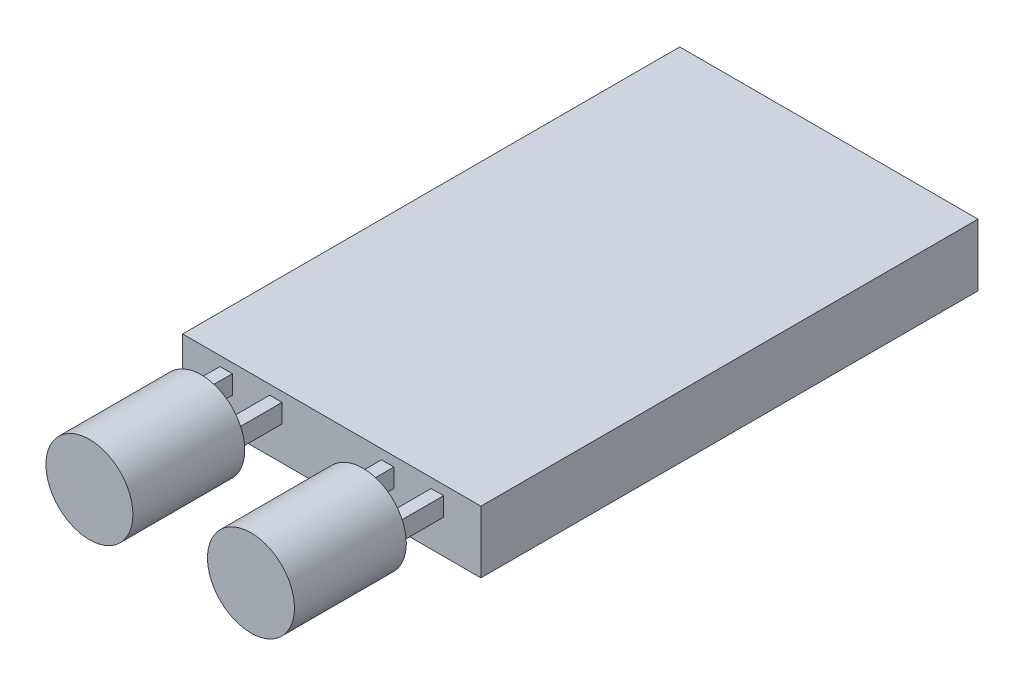
ISO-10303-21;
HEADER;
FILE_DESCRIPTION(('STEP AP214'),'2;1');
FILE_NAME('part.step','',(''),(''),'','','');
FILE_SCHEMA(('AUTOMOTIVE_DESIGN { 1 0 10303 214 1 1 1 1 }'));
ENDSEC;
DATA;
#1=APPLICATION_CONTEXT('core data for automotive mechanical design processes');
#2=APPLICATION_PROTOCOL_DEFINITION('international standard','automotive_design',2000,#1);
#3=PRODUCT_CONTEXT('',#1,'mechanical');
#4=PRODUCT('Part','Part','',(#3));
#5=PRODUCT_RELATED_PRODUCT_CATEGORY('part','',(#4));
#6=PRODUCT_DEFINITION_FORMATION('','',#4);
#7=PRODUCT_DEFINITION_CONTEXT('part definition',#1,'design');
#8=PRODUCT_DEFINITION('design','',#6,#7);
#9=PRODUCT_DEFINITION_SHAPE('','',#8);
#10=(LENGTH_UNIT() NAMED_UNIT(*) SI_UNIT(.MILLI.,.METRE.));
#11=(NAMED_UNIT(*) PLANE_ANGLE_UNIT() SI_UNIT($,.RADIAN.));
#12=(NAMED_UNIT(*) SI_UNIT($,.STERADIAN.) SOLID_ANGLE_UNIT());
#13=UNCERTAINTY_MEASURE_WITH_UNIT(LENGTH_MEASURE(1.E-05),#10,'distance_accuracy_value','');
#14=(GEOMETRIC_REPRESENTATION_CONTEXT(3) GLOBAL_UNCERTAINTY_ASSIGNED_CONTEXT((#13)) GLOBAL_UNIT_ASSIGNED_CONTEXT((#10,
#11,#12)) REPRESENTATION_CONTEXT('',''));
#15=CARTESIAN_POINT('',(0.,0.,0.));
#16=DIRECTION('',(0.,0.,1.));
#17=DIRECTION('',(1.,0.,0.));
#18=AXIS2_PLACEMENT_3D('',#15,#16,#17);
#19=CARTESIAN_POINT('',(-24.,5.,-9.42857142857144));
#20=DIRECTION('',(1.,0.,0.));
#21=DIRECTION('',(0.,0.,-1.));
#22=AXIS2_PLACEMENT_3D('',#19,#20,#21);
#23=PLANE('',#22);
#24=DIRECTION('',(0.,0.,1.));
#25=VECTOR('',#24,1.);
#26=CARTESIAN_POINT('',(-24.,0.,-9.42857142857144));
#27=LINE('',#26,#25);
#28=CARTESIAN_POINT('',(-24.,0.,-9.42857142857144));
#29=VERTEX_POINT('',#28);
#30=CARTESIAN_POINT('',(-24.,0.,30.5714285714286));
#31=VERTEX_POINT('',#30);
#32=EDGE_CURVE('E256',#29,#31,#27,.T.);
#33=ORIENTED_EDGE('',*,*,#32,.T.);
#34=DIRECTION('',(0.,-1.,0.));
#35=VECTOR('',#34,1.);
#36=CARTESIAN_POINT('',(-24.,5.,30.5714285714286));
#37=LINE('',#36,#35);
#38=CARTESIAN_POINT('',(-24.,5.,30.5714285714286));
#39=VERTEX_POINT('',#38);
#40=EDGE_CURVE('E11',#39,#31,#37,.T.);
#41=ORIENTED_EDGE('',*,*,#40,.F.);
#42=DIRECTION('',(0.,0.,1.));
#43=VECTOR('',#42,1.);
#44=CARTESIAN_POINT('',(-24.,5.,-9.42857142857144));
#45=LINE('',#44,#43);
#46=CARTESIAN_POINT('',(-24.,5.,-9.42857142857144));
#47=VERTEX_POINT('',#46);
#48=EDGE_CURVE('E257',#47,#39,#45,.T.);
#49=ORIENTED_EDGE('',*,*,#48,.F.);
#50=DIRECTION('',(0.,-1.,0.));
#51=VECTOR('',#50,1.);
#52=CARTESIAN_POINT('',(-24.,5.,-9.42857142857144));
#53=LINE('',#52,#51);
#54=EDGE_CURVE('E267',#47,#29,#53,.T.);
#55=ORIENTED_EDGE('',*,*,#54,.T.);
#56=EDGE_LOOP('',(#33,#41,#49,#55));
#57=FACE_BOUND('',#56,.T.);
#58=ADVANCED_FACE('F35',(#57),#23,.F.);
#59=CARTESIAN_POINT('',(-24.,5.,30.5714285714286));
#60=DIRECTION('',(0.,0.,-1.));
#61=DIRECTION('',(-1.,0.,0.));
#62=AXIS2_PLACEMENT_3D('',#59,#60,#61);
#63=PLANE('',#62);
#64=DIRECTION('',(0.,1.,0.));
#65=VECTOR('',#64,1.);
#66=CARTESIAN_POINT('',(-21.,5.,30.5714285714286));
#67=LINE('',#66,#65);
#68=CARTESIAN_POINT('',(-21.,2.72951883751349,30.5714285714286));
#69=VERTEX_POINT('',#68);
#70=CARTESIAN_POINT('',(-21.,4.22951883751349,30.5714285714286));
#71=VERTEX_POINT('',#70);
#72=EDGE_CURVE('E440',#69,#71,#67,.T.);
#73=ORIENTED_EDGE('',*,*,#72,.T.);
#74=DIRECTION('',(1.,0.,0.));
#75=VECTOR('',#74,1.);
#76=CARTESIAN_POINT('',(-24.,4.22951883751349,30.5714285714286));
#77=LINE('',#76,#75);
#78=CARTESIAN_POINT('',(-20.,4.22951883751349,30.5714285714286));
#79=VERTEX_POINT('',#78);
#80=EDGE_CURVE('E442',#71,#79,#77,.T.);
#81=ORIENTED_EDGE('',*,*,#80,.T.);
#82=DIRECTION('',(0.,-1.,0.));
#83=VECTOR('',#82,1.);
#84=CARTESIAN_POINT('',(-20.,5.,30.5714285714286));
#85=LINE('',#84,#83);
#86=CARTESIAN_POINT('',(-20.,2.72951883751349,30.5714285714286));
#87=VERTEX_POINT('',#86);
#88=EDGE_CURVE('E428',#79,#87,#85,.T.);
#89=ORIENTED_EDGE('',*,*,#88,.T.);
#90=DIRECTION('',(-1.,0.,0.));
#91=VECTOR('',#90,1.);
#92=CARTESIAN_POINT('',(-24.,2.72951883751348,30.5714285714286));
#93=LINE('',#92,#91);
#94=EDGE_CURVE('E437',#87,#69,#93,.T.);
#95=ORIENTED_EDGE('',*,*,#94,.T.);
#96=EDGE_LOOP('',(#73,#81,#89,#95));
#97=FACE_BOUND('',#96,.T.);
#98=DIRECTION('',(0.,1.,0.));
#99=VECTOR('',#98,1.);
#100=CARTESIAN_POINT('',(-17.,5.,30.5714285714286));
#101=LINE('',#100,#99);
#102=CARTESIAN_POINT('',(-17.,2.72951883751348,30.5714285714286));
#103=VERTEX_POINT('',#102);
#104=CARTESIAN_POINT('',(-17.,4.22951883751348,30.5714285714286));
#105=VERTEX_POINT('',#104);
#106=EDGE_CURVE('E201',#103,#105,#101,.T.);
#107=ORIENTED_EDGE('',*,*,#106,.T.);
#108=DIRECTION('',(1.,0.,0.));
#109=VECTOR('',#108,1.);
#110=CARTESIAN_POINT('',(-24.,4.22951883751348,30.5714285714286));
#111=LINE('',#110,#109);
#112=CARTESIAN_POINT('',(-16.,4.22951883751348,30.5714285714286));
#113=VERTEX_POINT('',#112);
#114=EDGE_CURVE('E198',#105,#113,#111,.T.);
#115=ORIENTED_EDGE('',*,*,#114,.T.);
#116=DIRECTION('',(0.,-1.,0.));
#117=VECTOR('',#116,1.);
#118=CARTESIAN_POINT('',(-16.,5.,30.5714285714286));
#119=LINE('',#118,#117);
#120=CARTESIAN_POINT('',(-16.,2.72951883751348,30.5714285714286));
#121=VERTEX_POINT('',#120);
#122=EDGE_CURVE('E460',#113,#121,#119,.T.);
#123=ORIENTED_EDGE('',*,*,#122,.T.);
#124=DIRECTION('',(-1.,0.,0.));
#125=VECTOR('',#124,1.);
#126=CARTESIAN_POINT('',(-24.,2.72951883751348,30.5714285714286));
#127=LINE('',#126,#125);
#128=EDGE_CURVE('E469',#121,#103,#127,.T.);
#129=ORIENTED_EDGE('',*,*,#128,.T.);
#130=EDGE_LOOP('',(#107,#115,#123,#129));
#131=FACE_BOUND('',#130,.T.);
#132=DIRECTION('',(1.,0.,0.));
#133=VECTOR('',#132,1.);
#134=CARTESIAN_POINT('',(-24.,4.22951883751349,30.5714285714286));
#135=LINE('',#134,#133);
#136=CARTESIAN_POINT('',(-8.,4.22951883751349,30.5714285714286));
#137=VERTEX_POINT('',#136);
#138=CARTESIAN_POINT('',(-7.,4.22951883751349,30.5714285714286));
#139=VERTEX_POINT('',#138);
#140=EDGE_CURVE('E216',#137,#139,#135,.T.);
#141=ORIENTED_EDGE('',*,*,#140,.T.);
#142=DIRECTION('',(0.,-1.,0.));
#143=VECTOR('',#142,1.);
#144=CARTESIAN_POINT('',(-7.,5.,30.5714285714286));
#145=LINE('',#144,#143);
#146=CARTESIAN_POINT('',(-7.,2.72951883751349,30.5714285714286));
#147=VERTEX_POINT('',#146);
#148=EDGE_CURVE('E219',#139,#147,#145,.T.);
#149=ORIENTED_EDGE('',*,*,#148,.T.);
#150=DIRECTION('',(-1.,0.,0.));
#151=VECTOR('',#150,1.);
#152=CARTESIAN_POINT('',(-24.,2.72951883751348,30.5714285714286));
#153=LINE('',#152,#151);
#154=CARTESIAN_POINT('',(-8.,2.72951883751349,30.5714285714286));
#155=VERTEX_POINT('',#154);
#156=EDGE_CURVE('E188',#147,#155,#153,.T.);
#157=ORIENTED_EDGE('',*,*,#156,.T.);
#158=DIRECTION('',(0.,1.,0.));
#159=VECTOR('',#158,1.);
#160=CARTESIAN_POINT('',(-8.,5.00000000000002,30.5714285714286));
#161=LINE('',#160,#159);
#162=EDGE_CURVE('E213',#155,#137,#161,.T.);
#163=ORIENTED_EDGE('',*,*,#162,.T.);
#164=EDGE_LOOP('',(#141,#149,#157,#163));
#165=FACE_BOUND('',#164,.T.);
#166=DIRECTION('',(1.,0.,0.));
#167=VECTOR('',#166,1.);
#168=CARTESIAN_POINT('',(-24.,4.22951883751348,30.5714285714286));
#169=LINE('',#168,#167);
#170=CARTESIAN_POINT('',(-4.,4.22951883751348,30.5714285714286));
#171=VERTEX_POINT('',#170);
#172=CARTESIAN_POINT('',(-3.,4.22951883751348,30.5714285714286));
#173=VERTEX_POINT('',#172);
#174=EDGE_CURVE('E250',#171,#173,#169,.T.);
#175=ORIENTED_EDGE('',*,*,#174,.T.);
#176=DIRECTION('',(0.,-1.,0.));
#177=VECTOR('',#176,1.);
#178=CARTESIAN_POINT('',(-3.,5.,30.5714285714286));
#179=LINE('',#178,#177);
#180=CARTESIAN_POINT('',(-3.,2.72951883751348,30.5714285714286));
#181=VERTEX_POINT('',#180);
#182=EDGE_CURVE('E253',#173,#181,#179,.T.);
#183=ORIENTED_EDGE('',*,*,#182,.T.);
#184=DIRECTION('',(-1.,0.,0.));
#185=VECTOR('',#184,1.);
#186=CARTESIAN_POINT('',(-24.,2.72951883751348,30.5714285714286));
#187=LINE('',#186,#185);
#188=CARTESIAN_POINT('',(-4.,2.72951883751348,30.5714285714286));
#189=VERTEX_POINT('',#188);
#190=EDGE_CURVE('E237',#181,#189,#187,.T.);
#191=ORIENTED_EDGE('',*,*,#190,.T.);
#192=DIRECTION('',(0.,1.,0.));
#193=VECTOR('',#192,1.);
#194=CARTESIAN_POINT('',(-4.,5.,30.5714285714286));
#195=LINE('',#194,#193);
#196=EDGE_CURVE('E247',#189,#171,#195,.T.);
#197=ORIENTED_EDGE('',*,*,#196,.T.);
#198=EDGE_LOOP('',(#175,#183,#191,#197));
#199=FACE_BOUND('',#198,.T.);
#200=DIRECTION('',(1.,0.,0.));
#201=VECTOR('',#200,1.);
#202=CARTESIAN_POINT('',(-24.,0.,30.5714285714286));
#203=LINE('',#202,#201);
#204=CARTESIAN_POINT('',(0.,0.,30.5714285714286));
#205=VERTEX_POINT('',#204);
#206=EDGE_CURVE('E270',#31,#205,#203,.T.);
#207=ORIENTED_EDGE('',*,*,#206,.T.);
#208=DIRECTION('',(0.,-1.,0.));
#209=VECTOR('',#208,1.);
#210=CARTESIAN_POINT('',(0.,5.,30.5714285714286));
#211=LINE('',#210,#209);
#212=CARTESIAN_POINT('',(0.,5.,30.5714285714286));
#213=VERTEX_POINT('',#212);
#214=EDGE_CURVE('E42',#213,#205,#211,.T.);
#215=ORIENTED_EDGE('',*,*,#214,.F.);
#216=DIRECTION('',(1.,0.,0.));
#217=VECTOR('',#216,1.);
#218=CARTESIAN_POINT('',(-24.,5.,30.5714285714286));
#219=LINE('',#218,#217);
#220=EDGE_CURVE('E260',#39,#213,#219,.T.);
#221=ORIENTED_EDGE('',*,*,#220,.F.);
#222=ORIENTED_EDGE('',*,*,#40,.T.);
#223=EDGE_LOOP('',(#207,#215,#221,#222));
#224=FACE_BOUND('',#223,.T.);
#225=ADVANCED_FACE('F300',(#97,#131,#165,#199,#224),#63,.F.);
#226=CARTESIAN_POINT('',(0.,5.,-9.42857142857144));
#227=DIRECTION('',(-1.,0.,0.));
#228=DIRECTION('',(0.,0.,1.));
#229=AXIS2_PLACEMENT_3D('',#226,#227,#228);
#230=PLANE('',#229);
#231=DIRECTION('',(0.,0.,-1.));
#232=VECTOR('',#231,1.);
#233=CARTESIAN_POINT('',(0.,0.,-9.42857142857144));
#234=LINE('',#233,#232);
#235=CARTESIAN_POINT('',(0.,0.,-9.42857142857144));
#236=VERTEX_POINT('',#235);
#237=EDGE_CURVE('E272',#205,#236,#234,.T.);
#238=ORIENTED_EDGE('',*,*,#237,.T.);
#239=DIRECTION('',(0.,-1.,0.));
#240=VECTOR('',#239,1.);
#241=CARTESIAN_POINT('',(0.,5.,-9.42857142857144));
#242=LINE('',#241,#240);
#243=CARTESIAN_POINT('',(0.,5.,-9.42857142857144));
#244=VERTEX_POINT('',#243);
#245=EDGE_CURVE('E277',#244,#236,#242,.T.);
#246=ORIENTED_EDGE('',*,*,#245,.F.);
#247=DIRECTION('',(0.,0.,-1.));
#248=VECTOR('',#247,1.);
#249=CARTESIAN_POINT('',(0.,5.,-9.42857142857144));
#250=LINE('',#249,#248);
#251=EDGE_CURVE('E263',#213,#244,#250,.T.);
#252=ORIENTED_EDGE('',*,*,#251,.F.);
#253=ORIENTED_EDGE('',*,*,#214,.T.);
#254=EDGE_LOOP('',(#238,#246,#252,#253));
#255=FACE_BOUND('',#254,.T.);
#256=ADVANCED_FACE('F284',(#255),#230,.F.);
#257=CARTESIAN_POINT('',(-24.,5.,-9.42857142857144));
#258=DIRECTION('',(0.,0.,1.));
#259=DIRECTION('',(1.,0.,0.));
#260=AXIS2_PLACEMENT_3D('',#257,#258,#259);
#261=PLANE('',#260);
#262=DIRECTION('',(-1.,0.,0.));
#263=VECTOR('',#262,1.);
#264=CARTESIAN_POINT('',(-24.,0.,-9.42857142857144));
#265=LINE('',#264,#263);
#266=EDGE_CURVE('E261',#236,#29,#265,.T.);
#267=ORIENTED_EDGE('',*,*,#266,.T.);
#268=ORIENTED_EDGE('',*,*,#54,.F.);
#269=DIRECTION('',(-1.,0.,0.));
#270=VECTOR('',#269,1.);
#271=CARTESIAN_POINT('',(-24.,5.,-9.42857142857144));
#272=LINE('',#271,#270);
#273=EDGE_CURVE('E265',#244,#47,#272,.T.);
#274=ORIENTED_EDGE('',*,*,#273,.F.);
#275=ORIENTED_EDGE('',*,*,#245,.T.);
#276=EDGE_LOOP('',(#267,#268,#274,#275));
#277=FACE_BOUND('',#276,.T.);
#278=ADVANCED_FACE('F293',(#277),#261,.F.);
#279=CARTESIAN_POINT('',(0.,5.,0.));
#280=DIRECTION('',(0.,1.,0.));
#281=DIRECTION('',(0.,0.,1.));
#282=AXIS2_PLACEMENT_3D('',#279,#280,#281);
#283=PLANE('',#282);
#284=ORIENTED_EDGE('',*,*,#48,.T.);
#285=ORIENTED_EDGE('',*,*,#220,.T.);
#286=ORIENTED_EDGE('',*,*,#251,.T.);
#287=ORIENTED_EDGE('',*,*,#273,.T.);
#288=EDGE_LOOP('',(#284,#285,#286,#287));
#289=FACE_BOUND('',#288,.T.);
#290=ADVANCED_FACE('F299',(#289),#283,.T.);
#291=CARTESIAN_POINT('',(0.,0.,0.));
#292=DIRECTION('',(0.,1.,0.));
#293=DIRECTION('',(0.,0.,1.));
#294=AXIS2_PLACEMENT_3D('',#291,#292,#293);
#295=PLANE('',#294);
#296=ORIENTED_EDGE('',*,*,#32,.F.);
#297=ORIENTED_EDGE('',*,*,#266,.F.);
#298=ORIENTED_EDGE('',*,*,#237,.F.);
#299=ORIENTED_EDGE('',*,*,#206,.F.);
#300=EDGE_LOOP('',(#296,#297,#298,#299));
#301=FACE_BOUND('',#300,.T.);
#302=ADVANCED_FACE('F290',(#301),#295,.F.);
#303=CARTESIAN_POINT('',(-3.,4.22951883751348,34.5714285714286));
#304=DIRECTION('',(1.,0.,0.));
#305=DIRECTION('',(0.,0.,-1.));
#306=AXIS2_PLACEMENT_3D('',#303,#304,#305);
#307=PLANE('',#306);
#308=ORIENTED_EDGE('',*,*,#182,.F.);
#309=DIRECTION('',(0.,0.,-1.));
#310=VECTOR('',#309,1.);
#311=CARTESIAN_POINT('',(-3.,4.22951883751348,34.5714285714286));
#312=LINE('',#311,#310);
#313=CARTESIAN_POINT('',(-3.,4.22951883751348,34.5714285714286));
#314=VERTEX_POINT('',#313);
#315=EDGE_CURVE('E234',#314,#173,#312,.T.);
#316=ORIENTED_EDGE('',*,*,#315,.F.);
#317=DIRECTION('',(0.,-1.,0.));
#318=VECTOR('',#317,1.);
#319=CARTESIAN_POINT('',(-3.,4.22951883751348,34.5714285714286));
#320=LINE('',#319,#318);
#321=CARTESIAN_POINT('',(-3.,2.72951883751348,34.5714285714286));
#322=VERTEX_POINT('',#321);
#323=EDGE_CURVE('E221',#314,#322,#320,.T.);
#324=ORIENTED_EDGE('',*,*,#323,.T.);
#325=DIRECTION('',(0.,0.,-1.));
#326=VECTOR('',#325,1.);
#327=CARTESIAN_POINT('',(-3.,2.72951883751348,34.5714285714286));
#328=LINE('',#327,#326);
#329=EDGE_CURVE('E233',#322,#181,#328,.T.);
#330=ORIENTED_EDGE('',*,*,#329,.T.);
#331=EDGE_LOOP('',(#308,#316,#324,#330));
#332=FACE_BOUND('',#331,.T.);
#333=ADVANCED_FACE('F315',(#332),#307,.T.);
#334=CARTESIAN_POINT('',(-3.,4.22951883751348,34.5714285714286));
#335=DIRECTION('',(0.,1.,0.));
#336=DIRECTION('',(0.,0.,1.));
#337=AXIS2_PLACEMENT_3D('',#334,#335,#336);
#338=PLANE('',#337);
#339=ORIENTED_EDGE('',*,*,#174,.F.);
#340=DIRECTION('',(0.,0.,-1.));
#341=VECTOR('',#340,1.);
#342=CARTESIAN_POINT('',(-4.,4.22951883751348,34.5714285714286));
#343=LINE('',#342,#341);
#344=CARTESIAN_POINT('',(-4.,4.22951883751348,34.5714285714286));
#345=VERTEX_POINT('',#344);
#346=EDGE_CURVE('E238',#345,#171,#343,.T.);
#347=ORIENTED_EDGE('',*,*,#346,.F.);
#348=DIRECTION('',(1.,0.,0.));
#349=VECTOR('',#348,1.);
#350=CARTESIAN_POINT('',(-3.,4.22951883751348,34.5714285714286));
#351=LINE('',#350,#349);
#352=EDGE_CURVE('E230',#345,#314,#351,.T.);
#353=ORIENTED_EDGE('',*,*,#352,.T.);
#354=ORIENTED_EDGE('',*,*,#315,.T.);
#355=EDGE_LOOP('',(#339,#347,#353,#354));
#356=FACE_BOUND('',#355,.T.);
#357=ADVANCED_FACE('F320',(#356),#338,.T.);
#358=CARTESIAN_POINT('',(-4.,4.22951883751348,34.5714285714286));
#359=DIRECTION('',(-1.,0.,0.));
#360=DIRECTION('',(0.,0.,1.));
#361=AXIS2_PLACEMENT_3D('',#358,#359,#360);
#362=PLANE('',#361);
#363=ORIENTED_EDGE('',*,*,#196,.F.);
#364=DIRECTION('',(0.,0.,-1.));
#365=VECTOR('',#364,1.);
#366=CARTESIAN_POINT('',(-4.,2.72951883751348,34.5714285714286));
#367=LINE('',#366,#365);
#368=CARTESIAN_POINT('',(-4.,2.72951883751348,34.5714285714286));
#369=VERTEX_POINT('',#368);
#370=EDGE_CURVE('E241',#369,#189,#367,.T.);
#371=ORIENTED_EDGE('',*,*,#370,.F.);
#372=DIRECTION('',(0.,1.,0.));
#373=VECTOR('',#372,1.);
#374=CARTESIAN_POINT('',(-4.,4.22951883751348,34.5714285714286));
#375=LINE('',#374,#373);
#376=EDGE_CURVE('E227',#369,#345,#375,.T.);
#377=ORIENTED_EDGE('',*,*,#376,.T.);
#378=ORIENTED_EDGE('',*,*,#346,.T.);
#379=EDGE_LOOP('',(#363,#371,#377,#378));
#380=FACE_BOUND('',#379,.T.);
#381=ADVANCED_FACE('F325',(#380),#362,.T.);
#382=CARTESIAN_POINT('',(-3.,2.72951883751348,34.5714285714286));
#383=DIRECTION('',(0.,-1.,0.));
#384=DIRECTION('',(0.,0.,-1.));
#385=AXIS2_PLACEMENT_3D('',#382,#383,#384);
#386=PLANE('',#385);
#387=ORIENTED_EDGE('',*,*,#190,.F.);
#388=ORIENTED_EDGE('',*,*,#329,.F.);
#389=DIRECTION('',(-1.,0.,0.));
#390=VECTOR('',#389,1.);
#391=CARTESIAN_POINT('',(-3.,2.72951883751348,34.5714285714286));
#392=LINE('',#391,#390);
#393=EDGE_CURVE('E224',#322,#369,#392,.T.);
#394=ORIENTED_EDGE('',*,*,#393,.T.);
#395=ORIENTED_EDGE('',*,*,#370,.T.);
#396=EDGE_LOOP('',(#387,#388,#394,#395));
#397=FACE_BOUND('',#396,.T.);
#398=ADVANCED_FACE('F322',(#397),#386,.T.);
#399=CARTESIAN_POINT('',(-7.,4.22951883751349,34.5714285714286));
#400=DIRECTION('',(1.,0.,0.));
#401=DIRECTION('',(0.,0.,-1.));
#402=AXIS2_PLACEMENT_3D('',#399,#400,#401);
#403=PLANE('',#402);
#404=ORIENTED_EDGE('',*,*,#148,.F.);
#405=DIRECTION('',(0.,0.,-1.));
#406=VECTOR('',#405,1.);
#407=CARTESIAN_POINT('',(-7.,4.22951883751349,34.5714285714286));
#408=LINE('',#407,#406);
#409=CARTESIAN_POINT('',(-7.,4.22951883751349,34.5714285714286));
#410=VERTEX_POINT('',#409);
#411=EDGE_CURVE('E196',#410,#139,#408,.T.);
#412=ORIENTED_EDGE('',*,*,#411,.F.);
#413=DIRECTION('',(0.,-1.,0.));
#414=VECTOR('',#413,1.);
#415=CARTESIAN_POINT('',(-7.,4.22951883751349,34.5714285714286));
#416=LINE('',#415,#414);
#417=CARTESIAN_POINT('',(-7.,2.72951883751349,34.5714285714286));
#418=VERTEX_POINT('',#417);
#419=EDGE_CURVE('E177',#410,#418,#416,.T.);
#420=ORIENTED_EDGE('',*,*,#419,.T.);
#421=DIRECTION('',(0.,0.,-1.));
#422=VECTOR('',#421,1.);
#423=CARTESIAN_POINT('',(-7.,2.72951883751349,34.5714285714286));
#424=LINE('',#423,#422);
#425=EDGE_CURVE('E185',#418,#147,#424,.T.);
#426=ORIENTED_EDGE('',*,*,#425,.T.);
#427=EDGE_LOOP('',(#404,#412,#420,#426));
#428=FACE_BOUND('',#427,.T.);
#429=ADVANCED_FACE('F194',(#428),#403,.T.);
#430=CARTESIAN_POINT('',(-7.,4.22951883751349,34.5714285714286));
#431=DIRECTION('',(0.,1.,0.));
#432=DIRECTION('',(0.,0.,1.));
#433=AXIS2_PLACEMENT_3D('',#430,#431,#432);
#434=PLANE('',#433);
#435=ORIENTED_EDGE('',*,*,#140,.F.);
#436=DIRECTION('',(0.,0.,-1.));
#437=VECTOR('',#436,1.);
#438=CARTESIAN_POINT('',(-8.,4.22951883751349,34.5714285714286));
#439=LINE('',#438,#437);
#440=CARTESIAN_POINT('',(-8.,4.22951883751349,34.5714285714286));
#441=VERTEX_POINT('',#440);
#442=EDGE_CURVE('E208',#441,#137,#439,.T.);
#443=ORIENTED_EDGE('',*,*,#442,.F.);
#444=DIRECTION('',(1.,0.,0.));
#445=VECTOR('',#444,1.);
#446=CARTESIAN_POINT('',(-7.,4.22951883751349,34.5714285714286));
#447=LINE('',#446,#445);
#448=EDGE_CURVE('E192',#441,#410,#447,.T.);
#449=ORIENTED_EDGE('',*,*,#448,.T.);
#450=ORIENTED_EDGE('',*,*,#411,.T.);
#451=EDGE_LOOP('',(#435,#443,#449,#450));
#452=FACE_BOUND('',#451,.T.);
#453=ADVANCED_FACE('F335',(#452),#434,.T.);
#454=CARTESIAN_POINT('',(-8.,4.22951883751349,34.5714285714286));
#455=DIRECTION('',(-1.,0.,0.));
#456=DIRECTION('',(0.,-1.,0.));
#457=AXIS2_PLACEMENT_3D('',#454,#455,#456);
#458=PLANE('',#457);
#459=ORIENTED_EDGE('',*,*,#162,.F.);
#460=DIRECTION('',(0.,0.,-1.));
#461=VECTOR('',#460,1.);
#462=CARTESIAN_POINT('',(-8.,2.72951883751349,34.5714285714286));
#463=LINE('',#462,#461);
#464=CARTESIAN_POINT('',(-8.,2.72951883751349,34.5714285714286));
#465=VERTEX_POINT('',#464);
#466=EDGE_CURVE('E191',#465,#155,#463,.T.);
#467=ORIENTED_EDGE('',*,*,#466,.F.);
#468=DIRECTION('',(0.,1.,0.));
#469=VECTOR('',#468,1.);
#470=CARTESIAN_POINT('',(-8.,4.22951883751349,34.5714285714286));
#471=LINE('',#470,#469);
#472=EDGE_CURVE('E180',#465,#441,#471,.T.);
#473=ORIENTED_EDGE('',*,*,#472,.T.);
#474=ORIENTED_EDGE('',*,*,#442,.T.);
#475=EDGE_LOOP('',(#459,#467,#473,#474));
#476=FACE_BOUND('',#475,.T.);
#477=ADVANCED_FACE('F339',(#476),#458,.T.);
#478=CARTESIAN_POINT('',(-7.,2.72951883751349,34.5714285714286));
#479=DIRECTION('',(0.,-1.,0.));
#480=DIRECTION('',(1.,0.,0.));
#481=AXIS2_PLACEMENT_3D('',#478,#479,#480);
#482=PLANE('',#481);
#483=ORIENTED_EDGE('',*,*,#156,.F.);
#484=ORIENTED_EDGE('',*,*,#425,.F.);
#485=DIRECTION('',(-1.,0.,0.));
#486=VECTOR('',#485,1.);
#487=CARTESIAN_POINT('',(-7.,2.72951883751349,34.5714285714286));
#488=LINE('',#487,#486);
#489=EDGE_CURVE('E172',#418,#465,#488,.T.);
#490=ORIENTED_EDGE('',*,*,#489,.T.);
#491=ORIENTED_EDGE('',*,*,#466,.T.);
#492=EDGE_LOOP('',(#483,#484,#490,#491));
#493=FACE_BOUND('',#492,.T.);
#494=ADVANCED_FACE('F186',(#493),#482,.T.);
#495=CARTESIAN_POINT('',(-16.,4.22951883751348,34.5714285714286));
#496=DIRECTION('',(0.,1.,0.));
#497=DIRECTION('',(0.,0.,1.));
#498=AXIS2_PLACEMENT_3D('',#495,#496,#497);
#499=PLANE('',#498);
#500=ORIENTED_EDGE('',*,*,#114,.F.);
#501=DIRECTION('',(0.,0.,-1.));
#502=VECTOR('',#501,1.);
#503=CARTESIAN_POINT('',(-17.,4.22951883751348,34.5714285714286));
#504=LINE('',#503,#502);
#505=CARTESIAN_POINT('',(-17.,4.22951883751348,34.5714285714286));
#506=VERTEX_POINT('',#505);
#507=EDGE_CURVE('E457',#506,#105,#504,.T.);
#508=ORIENTED_EDGE('',*,*,#507,.F.);
#509=DIRECTION('',(1.,0.,0.));
#510=VECTOR('',#509,1.);
#511=CARTESIAN_POINT('',(-16.,4.22951883751348,34.5714285714286));
#512=LINE('',#511,#510);
#513=CARTESIAN_POINT('',(-16.,4.22951883751348,34.5714285714286));
#514=VERTEX_POINT('',#513);
#515=EDGE_CURVE('E445',#506,#514,#512,.T.);
#516=ORIENTED_EDGE('',*,*,#515,.T.);
#517=DIRECTION('',(0.,0.,-1.));
#518=VECTOR('',#517,1.);
#519=CARTESIAN_POINT('',(-16.,4.22951883751348,34.5714285714286));
#520=LINE('',#519,#518);
#521=EDGE_CURVE('E456',#514,#113,#520,.T.);
#522=ORIENTED_EDGE('',*,*,#521,.T.);
#523=EDGE_LOOP('',(#500,#508,#516,#522));
#524=FACE_BOUND('',#523,.T.);
#525=ADVANCED_FACE('F338',(#524),#499,.T.);
#526=CARTESIAN_POINT('',(-17.,4.22951883751348,34.5714285714286));
#527=DIRECTION('',(-1.,0.,0.));
#528=DIRECTION('',(0.,0.,1.));
#529=AXIS2_PLACEMENT_3D('',#526,#527,#528);
#530=PLANE('',#529);
#531=ORIENTED_EDGE('',*,*,#106,.F.);
#532=DIRECTION('',(0.,0.,-1.));
#533=VECTOR('',#532,1.);
#534=CARTESIAN_POINT('',(-17.,2.72951883751348,34.5714285714286));
#535=LINE('',#534,#533);
#536=CARTESIAN_POINT('',(-17.,2.72951883751348,34.5714285714286));
#537=VERTEX_POINT('',#536);
#538=EDGE_CURVE('E461',#537,#103,#535,.T.);
#539=ORIENTED_EDGE('',*,*,#538,.F.);
#540=DIRECTION('',(0.,1.,0.));
#541=VECTOR('',#540,1.);
#542=CARTESIAN_POINT('',(-17.,4.22951883751348,34.5714285714286));
#543=LINE('',#542,#541);
#544=EDGE_CURVE('E453',#537,#506,#543,.T.);
#545=ORIENTED_EDGE('',*,*,#544,.T.);
#546=ORIENTED_EDGE('',*,*,#507,.T.);
#547=EDGE_LOOP('',(#531,#539,#545,#546));
#548=FACE_BOUND('',#547,.T.);
#549=ADVANCED_FACE('F348',(#548),#530,.T.);
#550=CARTESIAN_POINT('',(-16.,2.72951883751348,34.5714285714286));
#551=DIRECTION('',(0.,-1.,0.));
#552=DIRECTION('',(0.,0.,-1.));
#553=AXIS2_PLACEMENT_3D('',#550,#551,#552);
#554=PLANE('',#553);
#555=ORIENTED_EDGE('',*,*,#128,.F.);
#556=DIRECTION('',(0.,0.,-1.));
#557=VECTOR('',#556,1.);
#558=CARTESIAN_POINT('',(-16.,2.72951883751348,34.5714285714286));
#559=LINE('',#558,#557);
#560=CARTESIAN_POINT('',(-16.,2.72951883751348,34.5714285714286));
#561=VERTEX_POINT('',#560);
#562=EDGE_CURVE('E57',#561,#121,#559,.T.);
#563=ORIENTED_EDGE('',*,*,#562,.F.);
#564=DIRECTION('',(-1.,0.,0.));
#565=VECTOR('',#564,1.);
#566=CARTESIAN_POINT('',(-16.,2.72951883751348,34.5714285714286));
#567=LINE('',#566,#565);
#568=EDGE_CURVE('E450',#561,#537,#567,.T.);
#569=ORIENTED_EDGE('',*,*,#568,.T.);
#570=ORIENTED_EDGE('',*,*,#538,.T.);
#571=EDGE_LOOP('',(#555,#563,#569,#570));
#572=FACE_BOUND('',#571,.T.);
#573=ADVANCED_FACE('F354',(#572),#554,.T.);
#574=CARTESIAN_POINT('',(-16.,4.22951883751348,34.5714285714286));
#575=DIRECTION('',(1.,0.,0.));
#576=DIRECTION('',(0.,0.,-1.));
#577=AXIS2_PLACEMENT_3D('',#574,#575,#576);
#578=PLANE('',#577);
#579=ORIENTED_EDGE('',*,*,#122,.F.);
#580=ORIENTED_EDGE('',*,*,#521,.F.);
#581=DIRECTION('',(0.,-1.,0.));
#582=VECTOR('',#581,1.);
#583=CARTESIAN_POINT('',(-16.,4.22951883751348,34.5714285714286));
#584=LINE('',#583,#582);
#585=EDGE_CURVE('E448',#514,#561,#584,.T.);
#586=ORIENTED_EDGE('',*,*,#585,.T.);
#587=ORIENTED_EDGE('',*,*,#562,.T.);
#588=EDGE_LOOP('',(#579,#580,#586,#587));
#589=FACE_BOUND('',#588,.T.);
#590=ADVANCED_FACE('F350',(#589),#578,.T.);
#591=CARTESIAN_POINT('',(-20.,4.22951883751349,34.5714285714286));
#592=DIRECTION('',(0.,1.,0.));
#593=DIRECTION('',(0.,0.,1.));
#594=AXIS2_PLACEMENT_3D('',#591,#592,#593);
#595=PLANE('',#594);
#596=ORIENTED_EDGE('',*,*,#80,.F.);
#597=DIRECTION('',(0.,0.,-1.));
#598=VECTOR('',#597,1.);
#599=CARTESIAN_POINT('',(-21.,4.22951883751349,34.5714285714286));
#600=LINE('',#599,#598);
#601=CARTESIAN_POINT('',(-21.,4.22951883751349,34.5714285714286));
#602=VERTEX_POINT('',#601);
#603=EDGE_CURVE('E425',#602,#71,#600,.T.);
#604=ORIENTED_EDGE('',*,*,#603,.F.);
#605=DIRECTION('',(1.,0.,0.));
#606=VECTOR('',#605,1.);
#607=CARTESIAN_POINT('',(-20.,4.22951883751349,34.5714285714286));
#608=LINE('',#607,#606);
#609=CARTESIAN_POINT('',(-20.,4.22951883751349,34.5714285714286));
#610=VERTEX_POINT('',#609);
#611=EDGE_CURVE('E412',#602,#610,#608,.T.);
#612=ORIENTED_EDGE('',*,*,#611,.T.);
#613=DIRECTION('',(0.,0.,-1.));
#614=VECTOR('',#613,1.);
#615=CARTESIAN_POINT('',(-20.,4.22951883751349,34.5714285714286));
#616=LINE('',#615,#614);
#617=EDGE_CURVE('E424',#610,#79,#616,.T.);
#618=ORIENTED_EDGE('',*,*,#617,.T.);
#619=EDGE_LOOP('',(#596,#604,#612,#618));
#620=FACE_BOUND('',#619,.T.);
#621=ADVANCED_FACE('F353',(#620),#595,.T.);
#622=CARTESIAN_POINT('',(-21.,4.22951883751349,34.5714285714286));
#623=DIRECTION('',(-1.,0.,0.));
#624=DIRECTION('',(0.,0.,1.));
#625=AXIS2_PLACEMENT_3D('',#622,#623,#624);
#626=PLANE('',#625);
#627=ORIENTED_EDGE('',*,*,#72,.F.);
#628=DIRECTION('',(0.,0.,-1.));
#629=VECTOR('',#628,1.);
#630=CARTESIAN_POINT('',(-21.,2.72951883751349,34.5714285714286));
#631=LINE('',#630,#629);
#632=CARTESIAN_POINT('',(-21.,2.72951883751349,34.5714285714286));
#633=VERTEX_POINT('',#632);
#634=EDGE_CURVE('E429',#633,#69,#631,.T.);
#635=ORIENTED_EDGE('',*,*,#634,.F.);
#636=DIRECTION('',(0.,1.,0.));
#637=VECTOR('',#636,1.);
#638=CARTESIAN_POINT('',(-21.,4.22951883751349,34.5714285714286));
#639=LINE('',#638,#637);
#640=EDGE_CURVE('E421',#633,#602,#639,.T.);
#641=ORIENTED_EDGE('',*,*,#640,.T.);
#642=ORIENTED_EDGE('',*,*,#603,.T.);
#643=EDGE_LOOP('',(#627,#635,#641,#642));
#644=FACE_BOUND('',#643,.T.);
#645=ADVANCED_FACE('F363',(#644),#626,.T.);
#646=CARTESIAN_POINT('',(-20.,2.72951883751349,34.5714285714286));
#647=DIRECTION('',(0.,-1.,0.));
#648=DIRECTION('',(1.,0.,0.));
#649=AXIS2_PLACEMENT_3D('',#646,#647,#648);
#650=PLANE('',#649);
#651=ORIENTED_EDGE('',*,*,#94,.F.);
#652=DIRECTION('',(0.,0.,-1.));
#653=VECTOR('',#652,1.);
#654=CARTESIAN_POINT('',(-20.,2.72951883751349,34.5714285714286));
#655=LINE('',#654,#653);
#656=CARTESIAN_POINT('',(-20.,2.72951883751349,34.5714285714286));
#657=VERTEX_POINT('',#656);
#658=EDGE_CURVE('E49',#657,#87,#655,.T.);
#659=ORIENTED_EDGE('',*,*,#658,.F.);
#660=DIRECTION('',(-1.,0.,0.));
#661=VECTOR('',#660,1.);
#662=CARTESIAN_POINT('',(-20.,2.72951883751349,34.5714285714286));
#663=LINE('',#662,#661);
#664=EDGE_CURVE('E418',#657,#633,#663,.T.);
#665=ORIENTED_EDGE('',*,*,#664,.T.);
#666=ORIENTED_EDGE('',*,*,#634,.T.);
#667=EDGE_LOOP('',(#651,#659,#665,#666));
#668=FACE_BOUND('',#667,.T.);
#669=ADVANCED_FACE('F369',(#668),#650,.T.);
#670=CARTESIAN_POINT('',(-20.,4.22951883751349,34.5714285714286));
#671=DIRECTION('',(1.,0.,0.));
#672=DIRECTION('',(0.,0.,-1.));
#673=AXIS2_PLACEMENT_3D('',#670,#671,#672);
#674=PLANE('',#673);
#675=ORIENTED_EDGE('',*,*,#88,.F.);
#676=ORIENTED_EDGE('',*,*,#617,.F.);
#677=DIRECTION('',(0.,-1.,0.));
#678=VECTOR('',#677,1.);
#679=CARTESIAN_POINT('',(-20.,4.22951883751349,34.5714285714286));
#680=LINE('',#679,#678);
#681=EDGE_CURVE('E416',#610,#657,#680,.T.);
#682=ORIENTED_EDGE('',*,*,#681,.T.);
#683=ORIENTED_EDGE('',*,*,#658,.T.);
#684=EDGE_LOOP('',(#675,#676,#682,#683));
#685=FACE_BOUND('',#684,.T.);
#686=ADVANCED_FACE('F365',(#685),#674,.T.);
#687=CARTESIAN_POINT('',(-18.5,3.40608752970275,43.5714285714286));
#688=DIRECTION('',(0.,0.,-1.));
#689=DIRECTION('',(-1.,0.,0.));
#690=AXIS2_PLACEMENT_3D('',#687,#688,#689);
#691=CYLINDRICAL_SURFACE('',#690,3.5);
#692=CARTESIAN_POINT('',(-18.5,3.40608752970275,43.5714285714286));
#693=DIRECTION('',(0.,0.,1.));
#694=DIRECTION('',(1.,0.,0.));
#695=AXIS2_PLACEMENT_3D('',#692,#693,#694);
#696=CIRCLE('',#695,3.5);
#697=CARTESIAN_POINT('',(-15.,3.40608752970275,43.5714285714286));
#698=VERTEX_POINT('',#697);
#699=EDGE_CURVE('E406',#698,#698,#696,.T.);
#700=ORIENTED_EDGE('',*,*,#699,.F.);
#701=EDGE_LOOP('',(#700));
#702=FACE_BOUND('',#701,.T.);
#703=CARTESIAN_POINT('',(-18.5,3.40608752970275,34.5714285714286));
#704=DIRECTION('',(0.,0.,1.));
#705=DIRECTION('',(1.,0.,0.));
#706=AXIS2_PLACEMENT_3D('',#703,#704,#705);
#707=CIRCLE('',#706,3.5);
#708=CARTESIAN_POINT('',(-15.,3.40608752970275,34.5714285714286));
#709=VERTEX_POINT('',#708);
#710=EDGE_CURVE('E402',#709,#709,#707,.T.);
#711=ORIENTED_EDGE('',*,*,#710,.T.);
#712=EDGE_LOOP('',(#711));
#713=FACE_BOUND('',#712,.T.);
#714=ADVANCED_FACE('F368',(#702,#713),#691,.T.);
#715=CARTESIAN_POINT('',(-18.5,3.40608752970275,43.5714285714286));
#716=DIRECTION('',(0.,0.,1.));
#717=DIRECTION('',(1.,0.,0.));
#718=AXIS2_PLACEMENT_3D('',#715,#716,#717);
#719=PLANE('',#718);
#720=ORIENTED_EDGE('',*,*,#699,.T.);
#721=EDGE_LOOP('',(#720));
#722=FACE_BOUND('',#721,.T.);
#723=ADVANCED_FACE('F378',(#722),#719,.T.);
#724=CARTESIAN_POINT('',(-18.5,3.40608752970275,34.5714285714286));
#725=DIRECTION('',(0.,0.,1.));
#726=DIRECTION('',(1.,0.,0.));
#727=AXIS2_PLACEMENT_3D('',#724,#725,#726);
#728=PLANE('',#727);
#729=ORIENTED_EDGE('',*,*,#515,.F.);
#730=ORIENTED_EDGE('',*,*,#544,.F.);
#731=ORIENTED_EDGE('',*,*,#568,.F.);
#732=ORIENTED_EDGE('',*,*,#585,.F.);
#733=EDGE_LOOP('',(#729,#730,#731,#732));
#734=FACE_BOUND('',#733,.T.);
#735=ORIENTED_EDGE('',*,*,#611,.F.);
#736=ORIENTED_EDGE('',*,*,#640,.F.);
#737=ORIENTED_EDGE('',*,*,#664,.F.);
#738=ORIENTED_EDGE('',*,*,#681,.F.);
#739=EDGE_LOOP('',(#735,#736,#737,#738));
#740=FACE_BOUND('',#739,.T.);
#741=ORIENTED_EDGE('',*,*,#710,.F.);
#742=EDGE_LOOP('',(#741));
#743=FACE_BOUND('',#742,.T.);
#744=ADVANCED_FACE('F380',(#734,#740,#743),#728,.F.);
#745=CARTESIAN_POINT('',(-5.5,3.4,43.5714285714286));
#746=DIRECTION('',(0.,0.,-1.));
#747=DIRECTION('',(-1.,0.,0.));
#748=AXIS2_PLACEMENT_3D('',#745,#746,#747);
#749=CYLINDRICAL_SURFACE('',#748,3.5);
#750=CARTESIAN_POINT('',(-5.5,3.4,43.5714285714286));
#751=DIRECTION('',(0.,0.,1.));
#752=DIRECTION('',(1.,0.,0.));
#753=AXIS2_PLACEMENT_3D('',#750,#751,#752);
#754=CIRCLE('',#753,3.5);
#755=CARTESIAN_POINT('',(-2.,3.4,43.5714285714286));
#756=VERTEX_POINT('',#755);
#757=EDGE_CURVE('E401',#756,#756,#754,.T.);
#758=ORIENTED_EDGE('',*,*,#757,.F.);
#759=EDGE_LOOP('',(#758));
#760=FACE_BOUND('',#759,.T.);
#761=CARTESIAN_POINT('',(-5.5,3.4,34.5714285714286));
#762=DIRECTION('',(0.,0.,1.));
#763=DIRECTION('',(1.,0.,0.));
#764=AXIS2_PLACEMENT_3D('',#761,#762,#763);
#765=CIRCLE('',#764,3.5);
#766=CARTESIAN_POINT('',(-2.,3.4,34.5714285714286));
#767=VERTEX_POINT('',#766);
#768=EDGE_CURVE('E403',#767,#767,#765,.T.);
#769=ORIENTED_EDGE('',*,*,#768,.T.);
#770=EDGE_LOOP('',(#769));
#771=FACE_BOUND('',#770,.T.);
#772=ADVANCED_FACE('F383',(#760,#771),#749,.T.);
#773=CARTESIAN_POINT('',(-5.5,3.4,43.5714285714286));
#774=DIRECTION('',(0.,0.,1.));
#775=DIRECTION('',(1.,0.,0.));
#776=AXIS2_PLACEMENT_3D('',#773,#774,#775);
#777=PLANE('',#776);
#778=ORIENTED_EDGE('',*,*,#757,.T.);
#779=EDGE_LOOP('',(#778));
#780=FACE_BOUND('',#779,.T.);
#781=ADVANCED_FACE('F390',(#780),#777,.T.);
#782=CARTESIAN_POINT('',(-5.5,3.4,34.5714285714286));
#783=DIRECTION('',(0.,0.,1.));
#784=DIRECTION('',(1.,0.,0.));
#785=AXIS2_PLACEMENT_3D('',#782,#783,#784);
#786=PLANE('',#785);
#787=ORIENTED_EDGE('',*,*,#323,.F.);
#788=ORIENTED_EDGE('',*,*,#352,.F.);
#789=ORIENTED_EDGE('',*,*,#376,.F.);
#790=ORIENTED_EDGE('',*,*,#393,.F.);
#791=EDGE_LOOP('',(#787,#788,#789,#790));
#792=FACE_BOUND('',#791,.T.);
#793=ORIENTED_EDGE('',*,*,#419,.F.);
#794=ORIENTED_EDGE('',*,*,#448,.F.);
#795=ORIENTED_EDGE('',*,*,#472,.F.);
#796=ORIENTED_EDGE('',*,*,#489,.F.);
#797=EDGE_LOOP('',(#793,#794,#795,#796));
#798=FACE_BOUND('',#797,.T.);
#799=ORIENTED_EDGE('',*,*,#768,.F.);
#800=EDGE_LOOP('',(#799));
#801=FACE_BOUND('',#800,.T.);
#802=ADVANCED_FACE('F174',(#792,#798,#801),#786,.F.);
#803=CLOSED_SHELL('',(#58,#225,#256,#278,#290,#302,#333,#357,#381,#398,#429,#453,#477,#494,#525,
#549,#573,#590,#621,#645,#669,#686,#714,#723,#744,#772,#781,#802));
#804=MANIFOLD_SOLID_BREP('B2',#803);
#805=ADVANCED_BREP_SHAPE_REPRESENTATION('',(#18,#804),#14);
#806=SHAPE_DEFINITION_REPRESENTATION(#9,#805);
ENDSEC;
END-ISO-10303-21;
